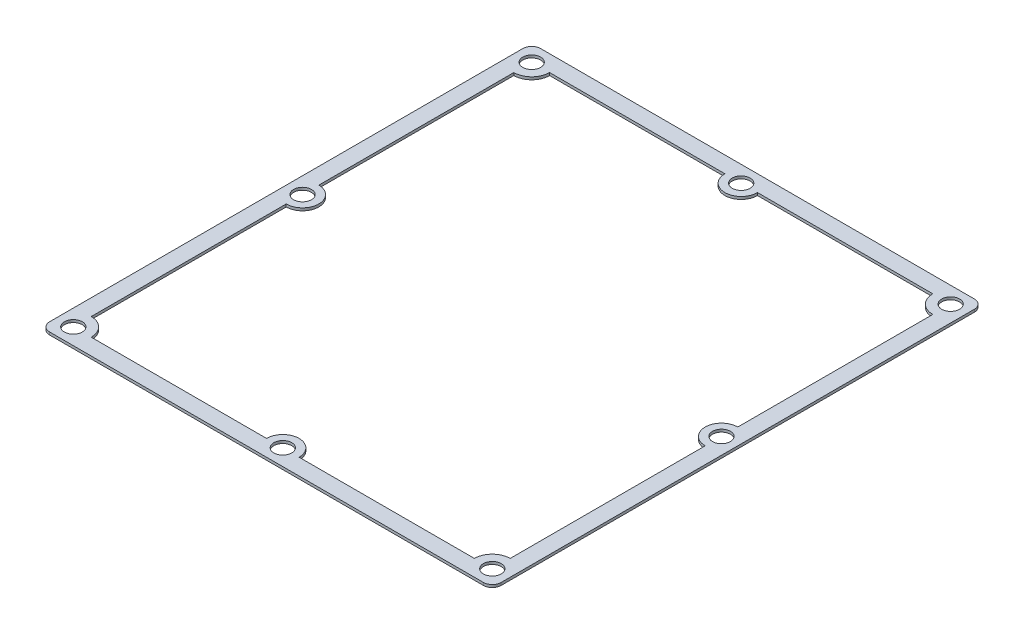
ISO-10303-21;
HEADER;
FILE_DESCRIPTION(('STEP AP214'),'2;1');
FILE_NAME('part.step','',(''),(''),'','','');
FILE_SCHEMA(('AUTOMOTIVE_DESIGN { 1 0 10303 214 1 1 1 1 }'));
ENDSEC;
DATA;
#1=APPLICATION_CONTEXT('core data for automotive mechanical design processes');
#2=APPLICATION_PROTOCOL_DEFINITION('international standard','automotive_design',2000,#1);
#3=PRODUCT_CONTEXT('',#1,'mechanical');
#4=PRODUCT('Part','Part','',(#3));
#5=PRODUCT_RELATED_PRODUCT_CATEGORY('part','',(#4));
#6=PRODUCT_DEFINITION_FORMATION('','',#4);
#7=PRODUCT_DEFINITION_CONTEXT('part definition',#1,'design');
#8=PRODUCT_DEFINITION('design','',#6,#7);
#9=PRODUCT_DEFINITION_SHAPE('','',#8);
#10=(LENGTH_UNIT() NAMED_UNIT(*) SI_UNIT(.MILLI.,.METRE.));
#11=(NAMED_UNIT(*) PLANE_ANGLE_UNIT() SI_UNIT($,.RADIAN.));
#12=(NAMED_UNIT(*) SI_UNIT($,.STERADIAN.) SOLID_ANGLE_UNIT());
#13=UNCERTAINTY_MEASURE_WITH_UNIT(LENGTH_MEASURE(1.E-05),#10,'distance_accuracy_value','');
#14=(GEOMETRIC_REPRESENTATION_CONTEXT(3) GLOBAL_UNCERTAINTY_ASSIGNED_CONTEXT((#13)) GLOBAL_UNIT_ASSIGNED_CONTEXT((#10,
#11,#12)) REPRESENTATION_CONTEXT('',''));
#15=CARTESIAN_POINT('',(0.,0.,0.));
#16=DIRECTION('',(0.,0.,1.));
#17=DIRECTION('',(1.,0.,0.));
#18=AXIS2_PLACEMENT_3D('',#15,#16,#17);
#19=CARTESIAN_POINT('',(-40.7710311675715,0.5,45.2112491208101));
#20=DIRECTION('',(0.,1.,0.));
#21=DIRECTION('',(0.,0.,1.));
#22=AXIS2_PLACEMENT_3D('',#19,#20,#21);
#23=PLANE('',#22);
#24=CARTESIAN_POINT('',(0.47896883242847,0.5,-43.3887508791899));
#25=DIRECTION('',(0.,1.,0.));
#26=DIRECTION('',(0.,0.,1.));
#27=AXIS2_PLACEMENT_3D('',#24,#25,#26);
#28=CIRCLE('',#27,1.7);
#29=CARTESIAN_POINT('',(0.47896883242847,0.5,-41.6887508791899));
#30=VERTEX_POINT('',#29);
#31=EDGE_CURVE('E323',#30,#30,#28,.T.);
#32=ORIENTED_EDGE('',*,*,#31,.F.);
#33=EDGE_LOOP('',(#32));
#34=FACE_BOUND('',#33,.T.);
#35=CARTESIAN_POINT('',(40.3289688324285,0.5,0.211249120810129));
#36=DIRECTION('',(0.,1.,0.));
#37=DIRECTION('',(0.,0.,1.));
#38=AXIS2_PLACEMENT_3D('',#35,#36,#37);
#39=CIRCLE('',#38,1.7);
#40=CARTESIAN_POINT('',(40.3289688324285,0.5,1.91124912081013));
#41=VERTEX_POINT('',#40);
#42=EDGE_CURVE('E335',#41,#41,#39,.T.);
#43=ORIENTED_EDGE('',*,*,#42,.F.);
#44=EDGE_LOOP('',(#43));
#45=FACE_BOUND('',#44,.T.);
#46=CARTESIAN_POINT('',(0.47896883242847,0.5,43.8112491208101));
#47=DIRECTION('',(0.,1.,0.));
#48=DIRECTION('',(0.,0.,1.));
#49=AXIS2_PLACEMENT_3D('',#46,#47,#48);
#50=CIRCLE('',#49,1.7);
#51=CARTESIAN_POINT('',(0.47896883242847,0.5,45.5112491208101));
#52=VERTEX_POINT('',#51);
#53=EDGE_CURVE('E347',#52,#52,#50,.T.);
#54=ORIENTED_EDGE('',*,*,#53,.F.);
#55=EDGE_LOOP('',(#54));
#56=FACE_BOUND('',#55,.T.);
#57=CARTESIAN_POINT('',(-39.3710311675715,0.5,0.211249120810129));
#58=DIRECTION('',(0.,1.,0.));
#59=DIRECTION('',(0.,0.,1.));
#60=AXIS2_PLACEMENT_3D('',#57,#58,#59);
#61=CIRCLE('',#60,1.7);
#62=CARTESIAN_POINT('',(-39.3710311675715,0.5,1.91124912081013));
#63=VERTEX_POINT('',#62);
#64=EDGE_CURVE('E359',#63,#63,#61,.T.);
#65=ORIENTED_EDGE('',*,*,#64,.F.);
#66=EDGE_LOOP('',(#65));
#67=FACE_BOUND('',#66,.T.);
#68=CARTESIAN_POINT('',(-40.7710311675715,0.5,45.2112491208101));
#69=DIRECTION('',(0.,1.,0.));
#70=DIRECTION('',(0.,0.,1.));
#71=AXIS2_PLACEMENT_3D('',#68,#69,#70);
#72=CIRCLE('',#71,1.7);
#73=CARTESIAN_POINT('',(-42.4710311675715,0.5,45.2112491208101));
#74=VERTEX_POINT('',#73);
#75=CARTESIAN_POINT('',(-40.7710311675715,0.5,46.9112491208101));
#76=VERTEX_POINT('',#75);
#77=EDGE_CURVE('E365',#74,#76,#72,.T.);
#78=ORIENTED_EDGE('',*,*,#77,.T.);
#79=DIRECTION('',(1.,0.,0.));
#80=VECTOR('',#79,1.);
#81=CARTESIAN_POINT('',(-40.7710311675715,0.5,46.9112491208101));
#82=LINE('',#81,#80);
#83=CARTESIAN_POINT('',(41.7289688324285,0.5,46.9112491208104));
#84=VERTEX_POINT('',#83);
#85=EDGE_CURVE('E368',#76,#84,#82,.T.);
#86=ORIENTED_EDGE('',*,*,#85,.T.);
#87=CARTESIAN_POINT('',(41.7289688324285,0.5,45.2112491208101));
#88=DIRECTION('',(0.,1.,0.));
#89=DIRECTION('',(0.,0.,1.));
#90=AXIS2_PLACEMENT_3D('',#87,#88,#89);
#91=CIRCLE('',#90,1.70000000000027);
#92=CARTESIAN_POINT('',(43.428968832429,0.5,45.21124912081));
#93=VERTEX_POINT('',#92);
#94=EDGE_CURVE('E371',#84,#93,#91,.T.);
#95=ORIENTED_EDGE('',*,*,#94,.T.);
#96=DIRECTION('',(0.,0.,-1.));
#97=VECTOR('',#96,1.);
#98=CARTESIAN_POINT('',(43.428968832429,0.5,45.21124912081));
#99=LINE('',#98,#97);
#100=CARTESIAN_POINT('',(43.4289688324295,0.5,-44.78875087919));
#101=VERTEX_POINT('',#100);
#102=EDGE_CURVE('E373',#93,#101,#99,.T.);
#103=ORIENTED_EDGE('',*,*,#102,.T.);
#104=CARTESIAN_POINT('',(41.7289688324295,0.5,-44.7887508791899));
#105=DIRECTION('',(0.,1.,0.));
#106=DIRECTION('',(0.,0.,1.));
#107=AXIS2_PLACEMENT_3D('',#104,#105,#106);
#108=CIRCLE('',#107,1.70000000000001);
#109=CARTESIAN_POINT('',(41.7289688324274,0.5,-46.4887508791899));
#110=VERTEX_POINT('',#109);
#111=EDGE_CURVE('E375',#101,#110,#108,.T.);
#112=ORIENTED_EDGE('',*,*,#111,.T.);
#113=DIRECTION('',(-1.,0.,0.));
#114=VECTOR('',#113,1.);
#115=CARTESIAN_POINT('',(41.7289688324274,0.5,-46.4887508791899));
#116=LINE('',#115,#114);
#117=CARTESIAN_POINT('',(-40.7710311675705,0.5,-46.4887508791899));
#118=VERTEX_POINT('',#117);
#119=EDGE_CURVE('E377',#110,#118,#116,.T.);
#120=ORIENTED_EDGE('',*,*,#119,.T.);
#121=CARTESIAN_POINT('',(-40.7710311675715,0.5,-44.7887508791899));
#122=DIRECTION('',(0.,1.,0.));
#123=DIRECTION('',(0.,0.,1.));
#124=AXIS2_PLACEMENT_3D('',#121,#122,#123);
#125=CIRCLE('',#124,1.7);
#126=CARTESIAN_POINT('',(-42.4710311675715,0.5,-44.7887508791899));
#127=VERTEX_POINT('',#126);
#128=EDGE_CURVE('E379',#118,#127,#125,.T.);
#129=ORIENTED_EDGE('',*,*,#128,.T.);
#130=DIRECTION('',(0.,0.,1.));
#131=VECTOR('',#130,1.);
#132=CARTESIAN_POINT('',(-42.4710311675715,0.5,-44.7887508791899));
#133=LINE('',#132,#131);
#134=EDGE_CURVE('E381',#127,#74,#133,.T.);
#135=ORIENTED_EDGE('',*,*,#134,.T.);
#136=EDGE_LOOP('',(#78,#86,#95,#103,#112,#120,#129,#135));
#137=FACE_BOUND('',#136,.T.);
#138=CARTESIAN_POINT('',(-39.3710311675715,0.5,43.8112491208101));
#139=DIRECTION('',(0.,1.,0.));
#140=DIRECTION('',(0.,0.,1.));
#141=AXIS2_PLACEMENT_3D('',#138,#139,#140);
#142=CIRCLE('',#141,1.7);
#143=CARTESIAN_POINT('',(-39.3710311675715,0.5,45.5112491208101));
#144=VERTEX_POINT('',#143);
#145=EDGE_CURVE('E353',#144,#144,#142,.T.);
#146=ORIENTED_EDGE('',*,*,#145,.F.);
#147=EDGE_LOOP('',(#146));
#148=FACE_BOUND('',#147,.T.);
#149=CARTESIAN_POINT('',(40.3289688324285,0.5,43.8112491208101));
#150=DIRECTION('',(0.,1.,0.));
#151=DIRECTION('',(0.,0.,1.));
#152=AXIS2_PLACEMENT_3D('',#149,#150,#151);
#153=CIRCLE('',#152,1.7);
#154=CARTESIAN_POINT('',(40.3289688324285,0.5,45.5112491208101));
#155=VERTEX_POINT('',#154);
#156=EDGE_CURVE('E341',#155,#155,#153,.T.);
#157=ORIENTED_EDGE('',*,*,#156,.F.);
#158=EDGE_LOOP('',(#157));
#159=FACE_BOUND('',#158,.T.);
#160=CARTESIAN_POINT('',(40.3289688324285,0.5,-43.3887508791899));
#161=DIRECTION('',(0.,1.,0.));
#162=DIRECTION('',(0.,0.,1.));
#163=AXIS2_PLACEMENT_3D('',#160,#161,#162);
#164=CIRCLE('',#163,1.7);
#165=CARTESIAN_POINT('',(40.3289688324285,0.5,-41.6887508791899));
#166=VERTEX_POINT('',#165);
#167=EDGE_CURVE('E329',#166,#166,#164,.T.);
#168=ORIENTED_EDGE('',*,*,#167,.F.);
#169=EDGE_LOOP('',(#168));
#170=FACE_BOUND('',#169,.T.);
#171=CARTESIAN_POINT('',(-39.3710311675715,0.5,-43.3887508791899));
#172=DIRECTION('',(0.,1.,0.));
#173=DIRECTION('',(0.,0.,1.));
#174=AXIS2_PLACEMENT_3D('',#171,#172,#173);
#175=CIRCLE('',#174,1.7);
#176=CARTESIAN_POINT('',(-39.3710311675715,0.5,-41.6887508791899));
#177=VERTEX_POINT('',#176);
#178=EDGE_CURVE('E317',#177,#177,#175,.T.);
#179=ORIENTED_EDGE('',*,*,#178,.F.);
#180=EDGE_LOOP('',(#179));
#181=FACE_BOUND('',#180,.T.);
#182=DIRECTION('',(-1.,0.,0.));
#183=VECTOR('',#182,1.);
#184=CARTESIAN_POINT('',(-35.969560897233,0.5,-43.3887508791899));
#185=LINE('',#184,#183);
#186=CARTESIAN_POINT('',(-2.62103116757153,0.5,-43.3887508791899));
#187=VERTEX_POINT('',#186);
#188=CARTESIAN_POINT('',(-35.969560897233,0.5,-43.3887508791899));
#189=VERTEX_POINT('',#188);
#190=EDGE_CURVE('E204',#187,#189,#185,.T.);
#191=ORIENTED_EDGE('',*,*,#190,.F.);
#192=CARTESIAN_POINT('',(0.47896883242847,0.5,-43.3887508791899));
#193=DIRECTION('',(0.,-1.,0.));
#194=DIRECTION('',(0.,0.,1.));
#195=AXIS2_PLACEMENT_3D('',#192,#193,#194);
#196=CIRCLE('',#195,3.1);
#197=CARTESIAN_POINT('',(3.57896883242847,0.5,-43.3887508791899));
#198=VERTEX_POINT('',#197);
#199=EDGE_CURVE('E196',#198,#187,#196,.T.);
#200=ORIENTED_EDGE('',*,*,#199,.F.);
#201=DIRECTION('',(-1.,0.,0.));
#202=VECTOR('',#201,1.);
#203=CARTESIAN_POINT('',(3.57896883242847,0.5,-43.3887508791899));
#204=LINE('',#203,#202);
#205=CARTESIAN_POINT('',(36.9274985620899,0.5,-43.3887508791899));
#206=VERTEX_POINT('',#205);
#207=EDGE_CURVE('E245',#206,#198,#204,.T.);
#208=ORIENTED_EDGE('',*,*,#207,.F.);
#209=CARTESIAN_POINT('',(40.3289688324285,0.5,-43.3887508791899));
#210=DIRECTION('',(0.,-1.,0.));
#211=DIRECTION('',(0.,0.,-1.));
#212=AXIS2_PLACEMENT_3D('',#209,#210,#211);
#213=CIRCLE('',#212,3.40147027033854);
#214=CARTESIAN_POINT('',(40.3289688324285,0.5,-39.9872806088513));
#215=VERTEX_POINT('',#214);
#216=EDGE_CURVE('E243',#215,#206,#213,.T.);
#217=ORIENTED_EDGE('',*,*,#216,.F.);
#218=DIRECTION('',(0.,0.,-1.));
#219=VECTOR('',#218,1.);
#220=CARTESIAN_POINT('',(40.3289688324285,0.5,-39.9872806088513));
#221=LINE('',#220,#219);
#222=CARTESIAN_POINT('',(40.3289688324285,0.5,-2.88875087919069));
#223=VERTEX_POINT('',#222);
#224=EDGE_CURVE('E241',#223,#215,#221,.T.);
#225=ORIENTED_EDGE('',*,*,#224,.F.);
#226=CARTESIAN_POINT('',(40.3289688324285,0.5,0.211249120810129));
#227=DIRECTION('',(0.,-1.,0.));
#228=DIRECTION('',(0.,0.,1.));
#229=AXIS2_PLACEMENT_3D('',#226,#227,#228);
#230=CIRCLE('',#229,3.10000000000082);
#231=CARTESIAN_POINT('',(40.3289688324285,0.5,3.31124912081095));
#232=VERTEX_POINT('',#231);
#233=EDGE_CURVE('E239',#232,#223,#230,.T.);
#234=ORIENTED_EDGE('',*,*,#233,.F.);
#235=DIRECTION('',(0.,0.,-1.));
#236=VECTOR('',#235,1.);
#237=CARTESIAN_POINT('',(40.3289688324285,0.5,3.31124912081095));
#238=LINE('',#237,#236);
#239=CARTESIAN_POINT('',(40.3289688324285,0.5,40.4097788504714));
#240=VERTEX_POINT('',#239);
#241=EDGE_CURVE('E237',#240,#232,#238,.T.);
#242=ORIENTED_EDGE('',*,*,#241,.F.);
#243=CARTESIAN_POINT('',(40.3289688324285,0.5,43.8112491208101));
#244=DIRECTION('',(0.,-1.,0.));
#245=DIRECTION('',(0.,0.,1.));
#246=AXIS2_PLACEMENT_3D('',#243,#244,#245);
#247=CIRCLE('',#246,3.40147027033863);
#248=CARTESIAN_POINT('',(36.9274985620898,0.5,43.8112491208099));
#249=VERTEX_POINT('',#248);
#250=EDGE_CURVE('E235',#249,#240,#247,.T.);
#251=ORIENTED_EDGE('',*,*,#250,.F.);
#252=DIRECTION('',(1.,0.,0.));
#253=VECTOR('',#252,1.);
#254=CARTESIAN_POINT('',(3.57896883242855,0.5,43.81124912081));
#255=LINE('',#254,#253);
#256=CARTESIAN_POINT('',(3.57896883242855,0.5,43.81124912081));
#257=VERTEX_POINT('',#256);
#258=EDGE_CURVE('E233',#257,#249,#255,.T.);
#259=ORIENTED_EDGE('',*,*,#258,.F.);
#260=CARTESIAN_POINT('',(0.47896883242847,0.5,43.8112491208101));
#261=DIRECTION('',(0.,-1.,0.));
#262=DIRECTION('',(0.,0.,-1.));
#263=AXIS2_PLACEMENT_3D('',#260,#261,#262);
#264=CIRCLE('',#263,3.1);
#265=CARTESIAN_POINT('',(-2.62103116757153,0.5,43.81124912081));
#266=VERTEX_POINT('',#265);
#267=EDGE_CURVE('E231',#266,#257,#264,.T.);
#268=ORIENTED_EDGE('',*,*,#267,.F.);
#269=DIRECTION('',(1.,0.,0.));
#270=VECTOR('',#269,1.);
#271=CARTESIAN_POINT('',(-35.9695608972328,0.5,43.8112491208101));
#272=LINE('',#271,#270);
#273=CARTESIAN_POINT('',(-35.9695608972328,0.5,43.8112491208101));
#274=VERTEX_POINT('',#273);
#275=EDGE_CURVE('E229',#274,#266,#272,.T.);
#276=ORIENTED_EDGE('',*,*,#275,.F.);
#277=CARTESIAN_POINT('',(-39.3710311675715,0.5,43.8112491208101));
#278=DIRECTION('',(0.,-1.,0.));
#279=DIRECTION('',(0.,0.,-1.));
#280=AXIS2_PLACEMENT_3D('',#277,#278,#279);
#281=CIRCLE('',#280,3.40147027033863);
#282=CARTESIAN_POINT('',(-39.3710311675714,0.5,40.4097788504715));
#283=VERTEX_POINT('',#282);
#284=EDGE_CURVE('E227',#283,#274,#281,.T.);
#285=ORIENTED_EDGE('',*,*,#284,.F.);
#286=DIRECTION('',(0.,0.,1.));
#287=VECTOR('',#286,1.);
#288=CARTESIAN_POINT('',(-39.3710311675715,0.5,3.31124912081014));
#289=LINE('',#288,#287);
#290=CARTESIAN_POINT('',(-39.3710311675715,0.5,3.31124912081014));
#291=VERTEX_POINT('',#290);
#292=EDGE_CURVE('E225',#291,#283,#289,.T.);
#293=ORIENTED_EDGE('',*,*,#292,.F.);
#294=CARTESIAN_POINT('',(-39.3710311675715,0.5,0.211249120810129));
#295=DIRECTION('',(0.,-1.,0.));
#296=DIRECTION('',(0.,0.,1.));
#297=AXIS2_PLACEMENT_3D('',#294,#295,#296);
#298=CIRCLE('',#297,3.10000000000001);
#299=CARTESIAN_POINT('',(-39.3710311675715,0.5,-2.88875087918988));
#300=VERTEX_POINT('',#299);
#301=EDGE_CURVE('E223',#300,#291,#298,.T.);
#302=ORIENTED_EDGE('',*,*,#301,.F.);
#303=DIRECTION('',(0.,0.,1.));
#304=VECTOR('',#303,1.);
#305=CARTESIAN_POINT('',(-39.3710311675715,0.5,-39.9872806088513));
#306=LINE('',#305,#304);
#307=CARTESIAN_POINT('',(-39.3710311675715,0.5,-39.9872806088513));
#308=VERTEX_POINT('',#307);
#309=EDGE_CURVE('E219',#308,#300,#306,.T.);
#310=ORIENTED_EDGE('',*,*,#309,.F.);
#311=CARTESIAN_POINT('',(-39.3710311675715,0.5,-43.3887508791899));
#312=DIRECTION('',(0.,-1.,0.));
#313=DIRECTION('',(0.,0.,1.));
#314=AXIS2_PLACEMENT_3D('',#311,#312,#313);
#315=CIRCLE('',#314,3.40147027033856);
#316=EDGE_CURVE('E217',#189,#308,#315,.T.);
#317=ORIENTED_EDGE('',*,*,#316,.F.);
#318=EDGE_LOOP('',(#191,#200,#208,#217,#225,#234,#242,#251,#259,#268,#276,#285,#293,#302,#310,#317));
#319=FACE_BOUND('',#318,.T.);
#320=ADVANCED_FACE('F35',(#34,#45,#56,#67,#137,#148,#159,#170,#181,#319),#23,.T.);
#321=CARTESIAN_POINT('',(-40.7710311675715,0.,45.2112491208101));
#322=DIRECTION('',(0.,1.,0.));
#323=DIRECTION('',(0.,0.,1.));
#324=AXIS2_PLACEMENT_3D('',#321,#322,#323);
#325=PLANE('',#324);
#326=CARTESIAN_POINT('',(-39.3710311675715,0.,-43.3887508791899));
#327=DIRECTION('',(0.,1.,0.));
#328=DIRECTION('',(0.,0.,1.));
#329=AXIS2_PLACEMENT_3D('',#326,#327,#328);
#330=CIRCLE('',#329,1.7);
#331=CARTESIAN_POINT('',(-39.3710311675715,0.,-41.6887508791899));
#332=VERTEX_POINT('',#331);
#333=EDGE_CURVE('E212',#332,#332,#330,.T.);
#334=ORIENTED_EDGE('',*,*,#333,.T.);
#335=EDGE_LOOP('',(#334));
#336=FACE_BOUND('',#335,.T.);
#337=CARTESIAN_POINT('',(0.47896883242847,0.,-43.3887508791899));
#338=DIRECTION('',(0.,1.,0.));
#339=DIRECTION('',(0.,0.,1.));
#340=AXIS2_PLACEMENT_3D('',#337,#338,#339);
#341=CIRCLE('',#340,1.7);
#342=CARTESIAN_POINT('',(0.47896883242847,0.,-41.6887508791899));
#343=VERTEX_POINT('',#342);
#344=EDGE_CURVE('E320',#343,#343,#341,.T.);
#345=ORIENTED_EDGE('',*,*,#344,.T.);
#346=EDGE_LOOP('',(#345));
#347=FACE_BOUND('',#346,.T.);
#348=CARTESIAN_POINT('',(40.3289688324285,0.,-43.3887508791899));
#349=DIRECTION('',(0.,1.,0.));
#350=DIRECTION('',(0.,0.,1.));
#351=AXIS2_PLACEMENT_3D('',#348,#349,#350);
#352=CIRCLE('',#351,1.7);
#353=CARTESIAN_POINT('',(40.3289688324285,0.,-41.6887508791899));
#354=VERTEX_POINT('',#353);
#355=EDGE_CURVE('E326',#354,#354,#352,.T.);
#356=ORIENTED_EDGE('',*,*,#355,.T.);
#357=EDGE_LOOP('',(#356));
#358=FACE_BOUND('',#357,.T.);
#359=CARTESIAN_POINT('',(40.3289688324285,0.,0.211249120810129));
#360=DIRECTION('',(0.,1.,0.));
#361=DIRECTION('',(0.,0.,1.));
#362=AXIS2_PLACEMENT_3D('',#359,#360,#361);
#363=CIRCLE('',#362,1.7);
#364=CARTESIAN_POINT('',(40.3289688324285,0.,1.91124912081013));
#365=VERTEX_POINT('',#364);
#366=EDGE_CURVE('E332',#365,#365,#363,.T.);
#367=ORIENTED_EDGE('',*,*,#366,.T.);
#368=EDGE_LOOP('',(#367));
#369=FACE_BOUND('',#368,.T.);
#370=CARTESIAN_POINT('',(40.3289688324285,0.,43.8112491208101));
#371=DIRECTION('',(0.,1.,0.));
#372=DIRECTION('',(0.,0.,1.));
#373=AXIS2_PLACEMENT_3D('',#370,#371,#372);
#374=CIRCLE('',#373,1.7);
#375=CARTESIAN_POINT('',(40.3289688324285,0.,45.5112491208101));
#376=VERTEX_POINT('',#375);
#377=EDGE_CURVE('E338',#376,#376,#374,.T.);
#378=ORIENTED_EDGE('',*,*,#377,.T.);
#379=EDGE_LOOP('',(#378));
#380=FACE_BOUND('',#379,.T.);
#381=CARTESIAN_POINT('',(0.47896883242847,0.,43.8112491208101));
#382=DIRECTION('',(0.,1.,0.));
#383=DIRECTION('',(0.,0.,1.));
#384=AXIS2_PLACEMENT_3D('',#381,#382,#383);
#385=CIRCLE('',#384,1.7);
#386=CARTESIAN_POINT('',(0.47896883242847,0.,45.5112491208101));
#387=VERTEX_POINT('',#386);
#388=EDGE_CURVE('E344',#387,#387,#385,.T.);
#389=ORIENTED_EDGE('',*,*,#388,.T.);
#390=EDGE_LOOP('',(#389));
#391=FACE_BOUND('',#390,.T.);
#392=CARTESIAN_POINT('',(-39.3710311675715,0.,43.8112491208101));
#393=DIRECTION('',(0.,1.,0.));
#394=DIRECTION('',(0.,0.,1.));
#395=AXIS2_PLACEMENT_3D('',#392,#393,#394);
#396=CIRCLE('',#395,1.7);
#397=CARTESIAN_POINT('',(-39.3710311675715,0.,45.5112491208101));
#398=VERTEX_POINT('',#397);
#399=EDGE_CURVE('E350',#398,#398,#396,.T.);
#400=ORIENTED_EDGE('',*,*,#399,.T.);
#401=EDGE_LOOP('',(#400));
#402=FACE_BOUND('',#401,.T.);
#403=CARTESIAN_POINT('',(-39.3710311675715,0.,0.211249120810129));
#404=DIRECTION('',(0.,1.,0.));
#405=DIRECTION('',(0.,0.,1.));
#406=AXIS2_PLACEMENT_3D('',#403,#404,#405);
#407=CIRCLE('',#406,1.7);
#408=CARTESIAN_POINT('',(-39.3710311675715,0.,1.91124912081013));
#409=VERTEX_POINT('',#408);
#410=EDGE_CURVE('E356',#409,#409,#407,.T.);
#411=ORIENTED_EDGE('',*,*,#410,.T.);
#412=EDGE_LOOP('',(#411));
#413=FACE_BOUND('',#412,.T.);
#414=CARTESIAN_POINT('',(-40.7710311675715,0.,45.2112491208101));
#415=DIRECTION('',(0.,1.,0.));
#416=DIRECTION('',(0.,0.,1.));
#417=AXIS2_PLACEMENT_3D('',#414,#415,#416);
#418=CIRCLE('',#417,1.7);
#419=CARTESIAN_POINT('',(-42.4710311675715,0.,45.2112491208101));
#420=VERTEX_POINT('',#419);
#421=CARTESIAN_POINT('',(-40.7710311675715,0.,46.9112491208101));
#422=VERTEX_POINT('',#421);
#423=EDGE_CURVE('E362',#420,#422,#418,.T.);
#424=ORIENTED_EDGE('',*,*,#423,.F.);
#425=DIRECTION('',(0.,0.,1.));
#426=VECTOR('',#425,1.);
#427=CARTESIAN_POINT('',(-42.4710311675715,0.,-44.7887508791899));
#428=LINE('',#427,#426);
#429=CARTESIAN_POINT('',(-42.4710311675715,0.,-44.7887508791899));
#430=VERTEX_POINT('',#429);
#431=EDGE_CURVE('E369',#430,#420,#428,.T.);
#432=ORIENTED_EDGE('',*,*,#431,.F.);
#433=CARTESIAN_POINT('',(-40.7710311675715,0.,-44.7887508791899));
#434=DIRECTION('',(0.,1.,0.));
#435=DIRECTION('',(0.,0.,1.));
#436=AXIS2_PLACEMENT_3D('',#433,#434,#435);
#437=CIRCLE('',#436,1.7);
#438=CARTESIAN_POINT('',(-40.7710311675705,0.,-46.4887508791899));
#439=VERTEX_POINT('',#438);
#440=EDGE_CURVE('E396',#439,#430,#437,.T.);
#441=ORIENTED_EDGE('',*,*,#440,.F.);
#442=DIRECTION('',(-1.,0.,0.));
#443=VECTOR('',#442,1.);
#444=CARTESIAN_POINT('',(41.7289688324274,0.,-46.4887508791899));
#445=LINE('',#444,#443);
#446=CARTESIAN_POINT('',(41.7289688324274,0.,-46.4887508791899));
#447=VERTEX_POINT('',#446);
#448=EDGE_CURVE('E394',#447,#439,#445,.T.);
#449=ORIENTED_EDGE('',*,*,#448,.F.);
#450=CARTESIAN_POINT('',(41.7289688324295,0.,-44.7887508791899));
#451=DIRECTION('',(0.,1.,0.));
#452=DIRECTION('',(0.,0.,1.));
#453=AXIS2_PLACEMENT_3D('',#450,#451,#452);
#454=CIRCLE('',#453,1.70000000000001);
#455=CARTESIAN_POINT('',(43.4289688324295,0.,-44.78875087919));
#456=VERTEX_POINT('',#455);
#457=EDGE_CURVE('E392',#456,#447,#454,.T.);
#458=ORIENTED_EDGE('',*,*,#457,.F.);
#459=DIRECTION('',(0.,0.,-1.));
#460=VECTOR('',#459,1.);
#461=CARTESIAN_POINT('',(43.428968832429,0.,45.21124912081));
#462=LINE('',#461,#460);
#463=CARTESIAN_POINT('',(43.428968832429,0.,45.21124912081));
#464=VERTEX_POINT('',#463);
#465=EDGE_CURVE('E390',#464,#456,#462,.T.);
#466=ORIENTED_EDGE('',*,*,#465,.F.);
#467=CARTESIAN_POINT('',(41.7289688324285,0.,45.2112491208101));
#468=DIRECTION('',(0.,1.,0.));
#469=DIRECTION('',(0.,0.,1.));
#470=AXIS2_PLACEMENT_3D('',#467,#468,#469);
#471=CIRCLE('',#470,1.70000000000027);
#472=CARTESIAN_POINT('',(41.7289688324285,0.,46.9112491208104));
#473=VERTEX_POINT('',#472);
#474=EDGE_CURVE('E388',#473,#464,#471,.T.);
#475=ORIENTED_EDGE('',*,*,#474,.F.);
#476=DIRECTION('',(1.,0.,0.));
#477=VECTOR('',#476,1.);
#478=CARTESIAN_POINT('',(-40.7710311675715,0.,46.9112491208101));
#479=LINE('',#478,#477);
#480=EDGE_CURVE('E386',#422,#473,#479,.T.);
#481=ORIENTED_EDGE('',*,*,#480,.F.);
#482=EDGE_LOOP('',(#424,#432,#441,#449,#458,#466,#475,#481));
#483=FACE_BOUND('',#482,.T.);
#484=CARTESIAN_POINT('',(0.47896883242847,0.,-43.3887508791899));
#485=DIRECTION('',(0.,-1.,0.));
#486=DIRECTION('',(0.,0.,1.));
#487=AXIS2_PLACEMENT_3D('',#484,#485,#486);
#488=CIRCLE('',#487,3.1);
#489=CARTESIAN_POINT('',(3.57896883242847,0.,-43.3887508791899));
#490=VERTEX_POINT('',#489);
#491=CARTESIAN_POINT('',(-2.62103116757153,0.,-43.3887508791899));
#492=VERTEX_POINT('',#491);
#493=EDGE_CURVE('E58',#490,#492,#488,.T.);
#494=ORIENTED_EDGE('',*,*,#493,.T.);
#495=DIRECTION('',(-1.,0.,0.));
#496=VECTOR('',#495,1.);
#497=CARTESIAN_POINT('',(-35.969560897233,0.,-43.3887508791899));
#498=LINE('',#497,#496);
#499=CARTESIAN_POINT('',(-35.969560897233,0.,-43.3887508791899));
#500=VERTEX_POINT('',#499);
#501=EDGE_CURVE('E211',#492,#500,#498,.T.);
#502=ORIENTED_EDGE('',*,*,#501,.T.);
#503=CARTESIAN_POINT('',(-39.3710311675715,0.,-43.3887508791899));
#504=DIRECTION('',(0.,-1.,0.));
#505=DIRECTION('',(0.,0.,1.));
#506=AXIS2_PLACEMENT_3D('',#503,#504,#505);
#507=CIRCLE('',#506,3.40147027033856);
#508=CARTESIAN_POINT('',(-39.3710311675715,0.,-39.9872806088513));
#509=VERTEX_POINT('',#508);
#510=EDGE_CURVE('E249',#500,#509,#507,.T.);
#511=ORIENTED_EDGE('',*,*,#510,.T.);
#512=DIRECTION('',(0.,0.,1.));
#513=VECTOR('',#512,1.);
#514=CARTESIAN_POINT('',(-39.3710311675715,0.,-39.9872806088513));
#515=LINE('',#514,#513);
#516=CARTESIAN_POINT('',(-39.3710311675715,0.,-2.88875087918988));
#517=VERTEX_POINT('',#516);
#518=EDGE_CURVE('E252',#509,#517,#515,.T.);
#519=ORIENTED_EDGE('',*,*,#518,.T.);
#520=CARTESIAN_POINT('',(-39.3710311675715,0.,0.211249120810129));
#521=DIRECTION('',(0.,-1.,0.));
#522=DIRECTION('',(0.,0.,1.));
#523=AXIS2_PLACEMENT_3D('',#520,#521,#522);
#524=CIRCLE('',#523,3.10000000000001);
#525=CARTESIAN_POINT('',(-39.3710311675715,0.,3.31124912081014));
#526=VERTEX_POINT('',#525);
#527=EDGE_CURVE('E255',#517,#526,#524,.T.);
#528=ORIENTED_EDGE('',*,*,#527,.T.);
#529=DIRECTION('',(0.,0.,1.));
#530=VECTOR('',#529,1.);
#531=CARTESIAN_POINT('',(-39.3710311675715,0.,3.31124912081014));
#532=LINE('',#531,#530);
#533=CARTESIAN_POINT('',(-39.3710311675714,0.,40.4097788504715));
#534=VERTEX_POINT('',#533);
#535=EDGE_CURVE('E258',#526,#534,#532,.T.);
#536=ORIENTED_EDGE('',*,*,#535,.T.);
#537=CARTESIAN_POINT('',(-39.3710311675715,0.,43.8112491208101));
#538=DIRECTION('',(0.,-1.,0.));
#539=DIRECTION('',(0.,0.,-1.));
#540=AXIS2_PLACEMENT_3D('',#537,#538,#539);
#541=CIRCLE('',#540,3.40147027033863);
#542=CARTESIAN_POINT('',(-35.9695608972328,0.,43.8112491208101));
#543=VERTEX_POINT('',#542);
#544=EDGE_CURVE('E261',#534,#543,#541,.T.);
#545=ORIENTED_EDGE('',*,*,#544,.T.);
#546=DIRECTION('',(1.,0.,0.));
#547=VECTOR('',#546,1.);
#548=CARTESIAN_POINT('',(-35.9695608972328,0.,43.8112491208101));
#549=LINE('',#548,#547);
#550=CARTESIAN_POINT('',(-2.62103116757153,0.,43.81124912081));
#551=VERTEX_POINT('',#550);
#552=EDGE_CURVE('E264',#543,#551,#549,.T.);
#553=ORIENTED_EDGE('',*,*,#552,.T.);
#554=CARTESIAN_POINT('',(0.47896883242847,0.,43.8112491208101));
#555=DIRECTION('',(0.,-1.,0.));
#556=DIRECTION('',(0.,0.,-1.));
#557=AXIS2_PLACEMENT_3D('',#554,#555,#556);
#558=CIRCLE('',#557,3.1);
#559=CARTESIAN_POINT('',(3.57896883242855,0.,43.81124912081));
#560=VERTEX_POINT('',#559);
#561=EDGE_CURVE('E267',#551,#560,#558,.T.);
#562=ORIENTED_EDGE('',*,*,#561,.T.);
#563=DIRECTION('',(1.,0.,0.));
#564=VECTOR('',#563,1.);
#565=CARTESIAN_POINT('',(3.57896883242855,0.,43.81124912081));
#566=LINE('',#565,#564);
#567=CARTESIAN_POINT('',(36.9274985620898,0.,43.8112491208099));
#568=VERTEX_POINT('',#567);
#569=EDGE_CURVE('E270',#560,#568,#566,.T.);
#570=ORIENTED_EDGE('',*,*,#569,.T.);
#571=CARTESIAN_POINT('',(40.3289688324285,0.,43.8112491208101));
#572=DIRECTION('',(0.,-1.,0.));
#573=DIRECTION('',(0.,0.,1.));
#574=AXIS2_PLACEMENT_3D('',#571,#572,#573);
#575=CIRCLE('',#574,3.40147027033863);
#576=CARTESIAN_POINT('',(40.3289688324285,0.,40.4097788504714));
#577=VERTEX_POINT('',#576);
#578=EDGE_CURVE('E273',#568,#577,#575,.T.);
#579=ORIENTED_EDGE('',*,*,#578,.T.);
#580=DIRECTION('',(0.,0.,-1.));
#581=VECTOR('',#580,1.);
#582=CARTESIAN_POINT('',(40.3289688324285,0.,3.31124912081095));
#583=LINE('',#582,#581);
#584=CARTESIAN_POINT('',(40.3289688324285,0.,3.31124912081095));
#585=VERTEX_POINT('',#584);
#586=EDGE_CURVE('E276',#577,#585,#583,.T.);
#587=ORIENTED_EDGE('',*,*,#586,.T.);
#588=CARTESIAN_POINT('',(40.3289688324285,0.,0.211249120810129));
#589=DIRECTION('',(0.,-1.,0.));
#590=DIRECTION('',(0.,0.,1.));
#591=AXIS2_PLACEMENT_3D('',#588,#589,#590);
#592=CIRCLE('',#591,3.10000000000082);
#593=CARTESIAN_POINT('',(40.3289688324285,0.,-2.88875087919069));
#594=VERTEX_POINT('',#593);
#595=EDGE_CURVE('E279',#585,#594,#592,.T.);
#596=ORIENTED_EDGE('',*,*,#595,.T.);
#597=DIRECTION('',(0.,0.,-1.));
#598=VECTOR('',#597,1.);
#599=CARTESIAN_POINT('',(40.3289688324285,0.,-39.9872806088513));
#600=LINE('',#599,#598);
#601=CARTESIAN_POINT('',(40.3289688324285,0.,-39.9872806088513));
#602=VERTEX_POINT('',#601);
#603=EDGE_CURVE('E282',#594,#602,#600,.T.);
#604=ORIENTED_EDGE('',*,*,#603,.T.);
#605=CARTESIAN_POINT('',(40.3289688324285,0.,-43.3887508791899));
#606=DIRECTION('',(0.,-1.,0.));
#607=DIRECTION('',(0.,0.,-1.));
#608=AXIS2_PLACEMENT_3D('',#605,#606,#607);
#609=CIRCLE('',#608,3.40147027033854);
#610=CARTESIAN_POINT('',(36.9274985620899,0.,-43.3887508791899));
#611=VERTEX_POINT('',#610);
#612=EDGE_CURVE('E285',#602,#611,#609,.T.);
#613=ORIENTED_EDGE('',*,*,#612,.T.);
#614=DIRECTION('',(-1.,0.,0.));
#615=VECTOR('',#614,1.);
#616=CARTESIAN_POINT('',(3.57896883242847,0.,-43.3887508791899));
#617=LINE('',#616,#615);
#618=EDGE_CURVE('E205',#611,#490,#617,.T.);
#619=ORIENTED_EDGE('',*,*,#618,.T.);
#620=EDGE_LOOP('',(#494,#502,#511,#519,#528,#536,#545,#553,#562,#570,#579,#587,#596,#604,#613,#619));
#621=FACE_BOUND('',#620,.T.);
#622=ADVANCED_FACE('F426',(#336,#347,#358,#369,#380,#391,#402,#413,#483,#621),#325,.F.);
#623=CARTESIAN_POINT('',(-40.7710311675715,0.5,45.2112491208101));
#624=DIRECTION('',(0.,-1.,0.));
#625=DIRECTION('',(0.,0.,-1.));
#626=AXIS2_PLACEMENT_3D('',#623,#624,#625);
#627=CYLINDRICAL_SURFACE('',#626,1.7);
#628=ORIENTED_EDGE('',*,*,#423,.T.);
#629=DIRECTION('',(0.,-1.,0.));
#630=VECTOR('',#629,1.);
#631=CARTESIAN_POINT('',(-40.7710311675715,0.5,46.9112491208101));
#632=LINE('',#631,#630);
#633=EDGE_CURVE('E11',#76,#422,#632,.T.);
#634=ORIENTED_EDGE('',*,*,#633,.F.);
#635=ORIENTED_EDGE('',*,*,#77,.F.);
#636=DIRECTION('',(0.,-1.,0.));
#637=VECTOR('',#636,1.);
#638=CARTESIAN_POINT('',(-42.4710311675715,0.5,45.2112491208101));
#639=LINE('',#638,#637);
#640=EDGE_CURVE('E383',#74,#420,#639,.T.);
#641=ORIENTED_EDGE('',*,*,#640,.T.);
#642=EDGE_LOOP('',(#628,#634,#635,#641));
#643=FACE_BOUND('',#642,.T.);
#644=ADVANCED_FACE('F37',(#643),#627,.T.);
#645=CARTESIAN_POINT('',(-40.7710311675715,0.5,46.9112491208101));
#646=DIRECTION('',(0.,0.,-1.));
#647=DIRECTION('',(-1.,0.,0.));
#648=AXIS2_PLACEMENT_3D('',#645,#646,#647);
#649=PLANE('',#648);
#650=ORIENTED_EDGE('',*,*,#480,.T.);
#651=DIRECTION('',(0.,-1.,0.));
#652=VECTOR('',#651,1.);
#653=CARTESIAN_POINT('',(41.7289688324285,0.5,46.9112491208104));
#654=LINE('',#653,#652);
#655=EDGE_CURVE('E43',#84,#473,#654,.T.);
#656=ORIENTED_EDGE('',*,*,#655,.F.);
#657=ORIENTED_EDGE('',*,*,#85,.F.);
#658=ORIENTED_EDGE('',*,*,#633,.T.);
#659=EDGE_LOOP('',(#650,#656,#657,#658));
#660=FACE_BOUND('',#659,.T.);
#661=ADVANCED_FACE('F444',(#660),#649,.F.);
#662=CARTESIAN_POINT('',(41.7289688324285,0.5,45.2112491208101));
#663=DIRECTION('',(0.,-1.,0.));
#664=DIRECTION('',(0.,0.,-1.));
#665=AXIS2_PLACEMENT_3D('',#662,#663,#664);
#666=CYLINDRICAL_SURFACE('',#665,1.70000000000027);
#667=ORIENTED_EDGE('',*,*,#474,.T.);
#668=DIRECTION('',(0.,-1.,0.));
#669=VECTOR('',#668,1.);
#670=CARTESIAN_POINT('',(43.428968832429,0.5,45.21124912081));
#671=LINE('',#670,#669);
#672=EDGE_CURVE('E413',#93,#464,#671,.T.);
#673=ORIENTED_EDGE('',*,*,#672,.F.);
#674=ORIENTED_EDGE('',*,*,#94,.F.);
#675=ORIENTED_EDGE('',*,*,#655,.T.);
#676=EDGE_LOOP('',(#667,#673,#674,#675));
#677=FACE_BOUND('',#676,.T.);
#678=ADVANCED_FACE('F420',(#677),#666,.T.);
#679=CARTESIAN_POINT('',(43.428968832429,0.5,45.21124912081));
#680=DIRECTION('',(-1.,0.,0.));
#681=DIRECTION('',(0.,0.,1.));
#682=AXIS2_PLACEMENT_3D('',#679,#680,#681);
#683=PLANE('',#682);
#684=ORIENTED_EDGE('',*,*,#465,.T.);
#685=DIRECTION('',(0.,-1.,0.));
#686=VECTOR('',#685,1.);
#687=CARTESIAN_POINT('',(43.4289688324295,0.5,-44.78875087919));
#688=LINE('',#687,#686);
#689=EDGE_CURVE('E410',#101,#456,#688,.T.);
#690=ORIENTED_EDGE('',*,*,#689,.F.);
#691=ORIENTED_EDGE('',*,*,#102,.F.);
#692=ORIENTED_EDGE('',*,*,#672,.T.);
#693=EDGE_LOOP('',(#684,#690,#691,#692));
#694=FACE_BOUND('',#693,.T.);
#695=ADVANCED_FACE('F432',(#694),#683,.F.);
#696=CARTESIAN_POINT('',(41.7289688324295,0.5,-44.7887508791899));
#697=DIRECTION('',(0.,-1.,0.));
#698=DIRECTION('',(0.,0.,-1.));
#699=AXIS2_PLACEMENT_3D('',#696,#697,#698);
#700=CYLINDRICAL_SURFACE('',#699,1.70000000000001);
#701=ORIENTED_EDGE('',*,*,#457,.T.);
#702=DIRECTION('',(0.,-1.,0.));
#703=VECTOR('',#702,1.);
#704=CARTESIAN_POINT('',(41.7289688324274,0.5,-46.4887508791899));
#705=LINE('',#704,#703);
#706=EDGE_CURVE('E407',#110,#447,#705,.T.);
#707=ORIENTED_EDGE('',*,*,#706,.F.);
#708=ORIENTED_EDGE('',*,*,#111,.F.);
#709=ORIENTED_EDGE('',*,*,#689,.T.);
#710=EDGE_LOOP('',(#701,#707,#708,#709));
#711=FACE_BOUND('',#710,.T.);
#712=ADVANCED_FACE('F436',(#711),#700,.T.);
#713=CARTESIAN_POINT('',(41.7289688324274,0.5,-46.4887508791899));
#714=DIRECTION('',(0.,0.,1.));
#715=DIRECTION('',(1.,0.,0.));
#716=AXIS2_PLACEMENT_3D('',#713,#714,#715);
#717=PLANE('',#716);
#718=ORIENTED_EDGE('',*,*,#448,.T.);
#719=DIRECTION('',(0.,-1.,0.));
#720=VECTOR('',#719,1.);
#721=CARTESIAN_POINT('',(-40.7710311675705,0.5,-46.4887508791899));
#722=LINE('',#721,#720);
#723=EDGE_CURVE('E404',#118,#439,#722,.T.);
#724=ORIENTED_EDGE('',*,*,#723,.F.);
#725=ORIENTED_EDGE('',*,*,#119,.F.);
#726=ORIENTED_EDGE('',*,*,#706,.T.);
#727=EDGE_LOOP('',(#718,#724,#725,#726));
#728=FACE_BOUND('',#727,.T.);
#729=ADVANCED_FACE('F457',(#728),#717,.F.);
#730=CARTESIAN_POINT('',(-40.7710311675715,0.5,-44.7887508791899));
#731=DIRECTION('',(0.,-1.,0.));
#732=DIRECTION('',(0.,0.,-1.));
#733=AXIS2_PLACEMENT_3D('',#730,#731,#732);
#734=CYLINDRICAL_SURFACE('',#733,1.7);
#735=ORIENTED_EDGE('',*,*,#440,.T.);
#736=DIRECTION('',(0.,-1.,0.));
#737=VECTOR('',#736,1.);
#738=CARTESIAN_POINT('',(-42.4710311675715,0.5,-44.7887508791899));
#739=LINE('',#738,#737);
#740=EDGE_CURVE('E401',#127,#430,#739,.T.);
#741=ORIENTED_EDGE('',*,*,#740,.F.);
#742=ORIENTED_EDGE('',*,*,#128,.F.);
#743=ORIENTED_EDGE('',*,*,#723,.T.);
#744=EDGE_LOOP('',(#735,#741,#742,#743));
#745=FACE_BOUND('',#744,.T.);
#746=ADVANCED_FACE('F455',(#745),#734,.T.);
#747=CARTESIAN_POINT('',(-42.4710311675715,0.5,-44.7887508791899));
#748=DIRECTION('',(1.,0.,0.));
#749=DIRECTION('',(0.,0.,-1.));
#750=AXIS2_PLACEMENT_3D('',#747,#748,#749);
#751=PLANE('',#750);
#752=ORIENTED_EDGE('',*,*,#431,.T.);
#753=ORIENTED_EDGE('',*,*,#640,.F.);
#754=ORIENTED_EDGE('',*,*,#134,.F.);
#755=ORIENTED_EDGE('',*,*,#740,.T.);
#756=EDGE_LOOP('',(#752,#753,#754,#755));
#757=FACE_BOUND('',#756,.T.);
#758=ADVANCED_FACE('F450',(#757),#751,.F.);
#759=CARTESIAN_POINT('',(-39.3710311675715,0.5,0.211249120810129));
#760=DIRECTION('',(0.,-1.,0.));
#761=DIRECTION('',(0.,0.,-1.));
#762=AXIS2_PLACEMENT_3D('',#759,#760,#761);
#763=CYLINDRICAL_SURFACE('',#762,1.7);
#764=ORIENTED_EDGE('',*,*,#64,.T.);
#765=EDGE_LOOP('',(#764));
#766=FACE_BOUND('',#765,.T.);
#767=ORIENTED_EDGE('',*,*,#410,.F.);
#768=EDGE_LOOP('',(#767));
#769=FACE_BOUND('',#768,.T.);
#770=ADVANCED_FACE('F477',(#766,#769),#763,.F.);
#771=CARTESIAN_POINT('',(-39.3710311675715,0.5,43.8112491208101));
#772=DIRECTION('',(0.,-1.,0.));
#773=DIRECTION('',(0.,0.,-1.));
#774=AXIS2_PLACEMENT_3D('',#771,#772,#773);
#775=CYLINDRICAL_SURFACE('',#774,1.7);
#776=ORIENTED_EDGE('',*,*,#145,.T.);
#777=EDGE_LOOP('',(#776));
#778=FACE_BOUND('',#777,.T.);
#779=ORIENTED_EDGE('',*,*,#399,.F.);
#780=EDGE_LOOP('',(#779));
#781=FACE_BOUND('',#780,.T.);
#782=ADVANCED_FACE('F484',(#778,#781),#775,.F.);
#783=CARTESIAN_POINT('',(0.47896883242847,0.5,43.8112491208101));
#784=DIRECTION('',(0.,-1.,0.));
#785=DIRECTION('',(0.,0.,-1.));
#786=AXIS2_PLACEMENT_3D('',#783,#784,#785);
#787=CYLINDRICAL_SURFACE('',#786,1.7);
#788=ORIENTED_EDGE('',*,*,#53,.T.);
#789=EDGE_LOOP('',(#788));
#790=FACE_BOUND('',#789,.T.);
#791=ORIENTED_EDGE('',*,*,#388,.F.);
#792=EDGE_LOOP('',(#791));
#793=FACE_BOUND('',#792,.T.);
#794=ADVANCED_FACE('F489',(#790,#793),#787,.F.);
#795=CARTESIAN_POINT('',(40.3289688324285,0.5,43.8112491208101));
#796=DIRECTION('',(0.,-1.,0.));
#797=DIRECTION('',(0.,0.,-1.));
#798=AXIS2_PLACEMENT_3D('',#795,#796,#797);
#799=CYLINDRICAL_SURFACE('',#798,1.7);
#800=ORIENTED_EDGE('',*,*,#156,.T.);
#801=EDGE_LOOP('',(#800));
#802=FACE_BOUND('',#801,.T.);
#803=ORIENTED_EDGE('',*,*,#377,.F.);
#804=EDGE_LOOP('',(#803));
#805=FACE_BOUND('',#804,.T.);
#806=ADVANCED_FACE('F499',(#802,#805),#799,.F.);
#807=CARTESIAN_POINT('',(40.3289688324285,0.5,0.211249120810129));
#808=DIRECTION('',(0.,-1.,0.));
#809=DIRECTION('',(0.,0.,-1.));
#810=AXIS2_PLACEMENT_3D('',#807,#808,#809);
#811=CYLINDRICAL_SURFACE('',#810,1.7);
#812=ORIENTED_EDGE('',*,*,#42,.T.);
#813=EDGE_LOOP('',(#812));
#814=FACE_BOUND('',#813,.T.);
#815=ORIENTED_EDGE('',*,*,#366,.F.);
#816=EDGE_LOOP('',(#815));
#817=FACE_BOUND('',#816,.T.);
#818=ADVANCED_FACE('F506',(#814,#817),#811,.F.);
#819=CARTESIAN_POINT('',(40.3289688324285,0.5,-43.3887508791899));
#820=DIRECTION('',(0.,-1.,0.));
#821=DIRECTION('',(0.,0.,-1.));
#822=AXIS2_PLACEMENT_3D('',#819,#820,#821);
#823=CYLINDRICAL_SURFACE('',#822,1.7);
#824=ORIENTED_EDGE('',*,*,#167,.T.);
#825=EDGE_LOOP('',(#824));
#826=FACE_BOUND('',#825,.T.);
#827=ORIENTED_EDGE('',*,*,#355,.F.);
#828=EDGE_LOOP('',(#827));
#829=FACE_BOUND('',#828,.T.);
#830=ADVANCED_FACE('F510',(#826,#829),#823,.F.);
#831=CARTESIAN_POINT('',(0.47896883242847,0.5,-43.3887508791899));
#832=DIRECTION('',(0.,-1.,0.));
#833=DIRECTION('',(0.,0.,-1.));
#834=AXIS2_PLACEMENT_3D('',#831,#832,#833);
#835=CYLINDRICAL_SURFACE('',#834,1.7);
#836=ORIENTED_EDGE('',*,*,#31,.T.);
#837=EDGE_LOOP('',(#836));
#838=FACE_BOUND('',#837,.T.);
#839=ORIENTED_EDGE('',*,*,#344,.F.);
#840=EDGE_LOOP('',(#839));
#841=FACE_BOUND('',#840,.T.);
#842=ADVANCED_FACE('F514',(#838,#841),#835,.F.);
#843=CARTESIAN_POINT('',(-39.3710311675715,0.5,-43.3887508791899));
#844=DIRECTION('',(0.,-1.,0.));
#845=DIRECTION('',(0.,0.,-1.));
#846=AXIS2_PLACEMENT_3D('',#843,#844,#845);
#847=CYLINDRICAL_SURFACE('',#846,1.7);
#848=ORIENTED_EDGE('',*,*,#178,.T.);
#849=EDGE_LOOP('',(#848));
#850=FACE_BOUND('',#849,.T.);
#851=ORIENTED_EDGE('',*,*,#333,.F.);
#852=EDGE_LOOP('',(#851));
#853=FACE_BOUND('',#852,.T.);
#854=ADVANCED_FACE('F518',(#850,#853),#847,.F.);
#855=CARTESIAN_POINT('',(0.47896883242847,0.5,-43.3887508791899));
#856=DIRECTION('',(0.,-1.,0.));
#857=DIRECTION('',(0.,0.,-1.));
#858=AXIS2_PLACEMENT_3D('',#855,#856,#857);
#859=CYLINDRICAL_SURFACE('',#858,3.1);
#860=ORIENTED_EDGE('',*,*,#493,.F.);
#861=DIRECTION('',(0.,-1.,0.));
#862=VECTOR('',#861,1.);
#863=CARTESIAN_POINT('',(3.57896883242847,0.5,-43.3887508791899));
#864=LINE('',#863,#862);
#865=EDGE_CURVE('E200',#198,#490,#864,.T.);
#866=ORIENTED_EDGE('',*,*,#865,.F.);
#867=ORIENTED_EDGE('',*,*,#199,.T.);
#868=DIRECTION('',(0.,-1.,0.));
#869=VECTOR('',#868,1.);
#870=CARTESIAN_POINT('',(-2.62103116757153,0.5,-43.3887508791899));
#871=LINE('',#870,#869);
#872=EDGE_CURVE('E199',#187,#492,#871,.T.);
#873=ORIENTED_EDGE('',*,*,#872,.T.);
#874=EDGE_LOOP('',(#860,#866,#867,#873));
#875=FACE_BOUND('',#874,.T.);
#876=ADVANCED_FACE('F198',(#875),#859,.T.);
#877=CARTESIAN_POINT('',(-35.969560897233,0.5,-43.3887508791899));
#878=DIRECTION('',(0.,0.,1.));
#879=DIRECTION('',(1.,0.,0.));
#880=AXIS2_PLACEMENT_3D('',#877,#878,#879);
#881=PLANE('',#880);
#882=ORIENTED_EDGE('',*,*,#501,.F.);
#883=ORIENTED_EDGE('',*,*,#872,.F.);
#884=ORIENTED_EDGE('',*,*,#190,.T.);
#885=DIRECTION('',(0.,-1.,0.));
#886=VECTOR('',#885,1.);
#887=CARTESIAN_POINT('',(-35.969560897233,0.5,-43.3887508791899));
#888=LINE('',#887,#886);
#889=EDGE_CURVE('E213',#189,#500,#888,.T.);
#890=ORIENTED_EDGE('',*,*,#889,.T.);
#891=EDGE_LOOP('',(#882,#883,#884,#890));
#892=FACE_BOUND('',#891,.T.);
#893=ADVANCED_FACE('F208',(#892),#881,.T.);
#894=CARTESIAN_POINT('',(-39.3710311675715,0.5,-43.3887508791899));
#895=DIRECTION('',(0.,-1.,0.));
#896=DIRECTION('',(0.,0.,-1.));
#897=AXIS2_PLACEMENT_3D('',#894,#895,#896);
#898=CYLINDRICAL_SURFACE('',#897,3.40147027033856);
#899=ORIENTED_EDGE('',*,*,#510,.F.);
#900=ORIENTED_EDGE('',*,*,#889,.F.);
#901=ORIENTED_EDGE('',*,*,#316,.T.);
#902=DIRECTION('',(0.,-1.,0.));
#903=VECTOR('',#902,1.);
#904=CARTESIAN_POINT('',(-39.3710311675715,0.5,-39.9872806088513));
#905=LINE('',#904,#903);
#906=EDGE_CURVE('E314',#308,#509,#905,.T.);
#907=ORIENTED_EDGE('',*,*,#906,.T.);
#908=EDGE_LOOP('',(#899,#900,#901,#907));
#909=FACE_BOUND('',#908,.T.);
#910=ADVANCED_FACE('F527',(#909),#898,.T.);
#911=CARTESIAN_POINT('',(-39.3710311675715,0.5,-39.9872806088513));
#912=DIRECTION('',(1.,0.,0.));
#913=DIRECTION('',(0.,0.,-1.));
#914=AXIS2_PLACEMENT_3D('',#911,#912,#913);
#915=PLANE('',#914);
#916=ORIENTED_EDGE('',*,*,#518,.F.);
#917=ORIENTED_EDGE('',*,*,#906,.F.);
#918=ORIENTED_EDGE('',*,*,#309,.T.);
#919=DIRECTION('',(0.,-1.,0.));
#920=VECTOR('',#919,1.);
#921=CARTESIAN_POINT('',(-39.3710311675715,0.5,-2.88875087918988));
#922=LINE('',#921,#920);
#923=EDGE_CURVE('E312',#300,#517,#922,.T.);
#924=ORIENTED_EDGE('',*,*,#923,.T.);
#925=EDGE_LOOP('',(#916,#917,#918,#924));
#926=FACE_BOUND('',#925,.T.);
#927=ADVANCED_FACE('F530',(#926),#915,.T.);
#928=CARTESIAN_POINT('',(-39.3710311675715,0.5,0.211249120810129));
#929=DIRECTION('',(0.,-1.,0.));
#930=DIRECTION('',(0.,0.,-1.));
#931=AXIS2_PLACEMENT_3D('',#928,#929,#930);
#932=CYLINDRICAL_SURFACE('',#931,3.10000000000001);
#933=ORIENTED_EDGE('',*,*,#527,.F.);
#934=ORIENTED_EDGE('',*,*,#923,.F.);
#935=ORIENTED_EDGE('',*,*,#301,.T.);
#936=DIRECTION('',(0.,-1.,0.));
#937=VECTOR('',#936,1.);
#938=CARTESIAN_POINT('',(-39.3710311675715,0.5,3.31124912081014));
#939=LINE('',#938,#937);
#940=EDGE_CURVE('E310',#291,#526,#939,.T.);
#941=ORIENTED_EDGE('',*,*,#940,.T.);
#942=EDGE_LOOP('',(#933,#934,#935,#941));
#943=FACE_BOUND('',#942,.T.);
#944=ADVANCED_FACE('F534',(#943),#932,.T.);
#945=CARTESIAN_POINT('',(-39.3710311675715,0.5,3.31124912081014));
#946=DIRECTION('',(1.,0.,0.));
#947=DIRECTION('',(0.,0.,-1.));
#948=AXIS2_PLACEMENT_3D('',#945,#946,#947);
#949=PLANE('',#948);
#950=ORIENTED_EDGE('',*,*,#535,.F.);
#951=ORIENTED_EDGE('',*,*,#940,.F.);
#952=ORIENTED_EDGE('',*,*,#292,.T.);
#953=DIRECTION('',(0.,-1.,0.));
#954=VECTOR('',#953,1.);
#955=CARTESIAN_POINT('',(-39.3710311675714,0.5,40.4097788504715));
#956=LINE('',#955,#954);
#957=EDGE_CURVE('E308',#283,#534,#956,.T.);
#958=ORIENTED_EDGE('',*,*,#957,.T.);
#959=EDGE_LOOP('',(#950,#951,#952,#958));
#960=FACE_BOUND('',#959,.T.);
#961=ADVANCED_FACE('F538',(#960),#949,.T.);
#962=CARTESIAN_POINT('',(-39.3710311675715,0.5,43.8112491208101));
#963=DIRECTION('',(0.,-1.,0.));
#964=DIRECTION('',(0.,0.,-1.));
#965=AXIS2_PLACEMENT_3D('',#962,#963,#964);
#966=CYLINDRICAL_SURFACE('',#965,3.40147027033863);
#967=ORIENTED_EDGE('',*,*,#544,.F.);
#968=ORIENTED_EDGE('',*,*,#957,.F.);
#969=ORIENTED_EDGE('',*,*,#284,.T.);
#970=DIRECTION('',(0.,-1.,0.));
#971=VECTOR('',#970,1.);
#972=CARTESIAN_POINT('',(-35.9695608972328,0.5,43.8112491208101));
#973=LINE('',#972,#971);
#974=EDGE_CURVE('E306',#274,#543,#973,.T.);
#975=ORIENTED_EDGE('',*,*,#974,.T.);
#976=EDGE_LOOP('',(#967,#968,#969,#975));
#977=FACE_BOUND('',#976,.T.);
#978=ADVANCED_FACE('F542',(#977),#966,.T.);
#979=CARTESIAN_POINT('',(-35.9695608972328,0.5,43.8112491208101));
#980=DIRECTION('',(0.,0.,-1.));
#981=DIRECTION('',(-1.,0.,0.));
#982=AXIS2_PLACEMENT_3D('',#979,#980,#981);
#983=PLANE('',#982);
#984=ORIENTED_EDGE('',*,*,#552,.F.);
#985=ORIENTED_EDGE('',*,*,#974,.F.);
#986=ORIENTED_EDGE('',*,*,#275,.T.);
#987=DIRECTION('',(0.,-1.,0.));
#988=VECTOR('',#987,1.);
#989=CARTESIAN_POINT('',(-2.62103116757153,0.5,43.81124912081));
#990=LINE('',#989,#988);
#991=EDGE_CURVE('E304',#266,#551,#990,.T.);
#992=ORIENTED_EDGE('',*,*,#991,.T.);
#993=EDGE_LOOP('',(#984,#985,#986,#992));
#994=FACE_BOUND('',#993,.T.);
#995=ADVANCED_FACE('F546',(#994),#983,.T.);
#996=CARTESIAN_POINT('',(0.47896883242847,0.5,43.8112491208101));
#997=DIRECTION('',(0.,-1.,0.));
#998=DIRECTION('',(0.,0.,-1.));
#999=AXIS2_PLACEMENT_3D('',#996,#997,#998);
#1000=CYLINDRICAL_SURFACE('',#999,3.1);
#1001=ORIENTED_EDGE('',*,*,#561,.F.);
#1002=ORIENTED_EDGE('',*,*,#991,.F.);
#1003=ORIENTED_EDGE('',*,*,#267,.T.);
#1004=DIRECTION('',(0.,-1.,0.));
#1005=VECTOR('',#1004,1.);
#1006=CARTESIAN_POINT('',(3.57896883242855,0.5,43.81124912081));
#1007=LINE('',#1006,#1005);
#1008=EDGE_CURVE('E302',#257,#560,#1007,.T.);
#1009=ORIENTED_EDGE('',*,*,#1008,.T.);
#1010=EDGE_LOOP('',(#1001,#1002,#1003,#1009));
#1011=FACE_BOUND('',#1010,.T.);
#1012=ADVANCED_FACE('F550',(#1011),#1000,.T.);
#1013=CARTESIAN_POINT('',(3.57896883242855,0.5,43.81124912081));
#1014=DIRECTION('',(0.,0.,-1.));
#1015=DIRECTION('',(-1.,0.,0.));
#1016=AXIS2_PLACEMENT_3D('',#1013,#1014,#1015);
#1017=PLANE('',#1016);
#1018=ORIENTED_EDGE('',*,*,#569,.F.);
#1019=ORIENTED_EDGE('',*,*,#1008,.F.);
#1020=ORIENTED_EDGE('',*,*,#258,.T.);
#1021=DIRECTION('',(0.,-1.,0.));
#1022=VECTOR('',#1021,1.);
#1023=CARTESIAN_POINT('',(36.9274985620898,0.5,43.8112491208099));
#1024=LINE('',#1023,#1022);
#1025=EDGE_CURVE('E300',#249,#568,#1024,.T.);
#1026=ORIENTED_EDGE('',*,*,#1025,.T.);
#1027=EDGE_LOOP('',(#1018,#1019,#1020,#1026));
#1028=FACE_BOUND('',#1027,.T.);
#1029=ADVANCED_FACE('F554',(#1028),#1017,.T.);
#1030=CARTESIAN_POINT('',(40.3289688324285,0.5,43.8112491208101));
#1031=DIRECTION('',(0.,-1.,0.));
#1032=DIRECTION('',(0.,0.,-1.));
#1033=AXIS2_PLACEMENT_3D('',#1030,#1031,#1032);
#1034=CYLINDRICAL_SURFACE('',#1033,3.40147027033863);
#1035=ORIENTED_EDGE('',*,*,#578,.F.);
#1036=ORIENTED_EDGE('',*,*,#1025,.F.);
#1037=ORIENTED_EDGE('',*,*,#250,.T.);
#1038=DIRECTION('',(0.,-1.,0.));
#1039=VECTOR('',#1038,1.);
#1040=CARTESIAN_POINT('',(40.3289688324285,0.5,40.4097788504714));
#1041=LINE('',#1040,#1039);
#1042=EDGE_CURVE('E298',#240,#577,#1041,.T.);
#1043=ORIENTED_EDGE('',*,*,#1042,.T.);
#1044=EDGE_LOOP('',(#1035,#1036,#1037,#1043));
#1045=FACE_BOUND('',#1044,.T.);
#1046=ADVANCED_FACE('F558',(#1045),#1034,.T.);
#1047=CARTESIAN_POINT('',(40.3289688324285,0.5,3.31124912081095));
#1048=DIRECTION('',(-1.,0.,0.));
#1049=DIRECTION('',(0.,0.,1.));
#1050=AXIS2_PLACEMENT_3D('',#1047,#1048,#1049);
#1051=PLANE('',#1050);
#1052=ORIENTED_EDGE('',*,*,#586,.F.);
#1053=ORIENTED_EDGE('',*,*,#1042,.F.);
#1054=ORIENTED_EDGE('',*,*,#241,.T.);
#1055=DIRECTION('',(0.,-1.,0.));
#1056=VECTOR('',#1055,1.);
#1057=CARTESIAN_POINT('',(40.3289688324285,0.5,3.31124912081095));
#1058=LINE('',#1057,#1056);
#1059=EDGE_CURVE('E296',#232,#585,#1058,.T.);
#1060=ORIENTED_EDGE('',*,*,#1059,.T.);
#1061=EDGE_LOOP('',(#1052,#1053,#1054,#1060));
#1062=FACE_BOUND('',#1061,.T.);
#1063=ADVANCED_FACE('F562',(#1062),#1051,.T.);
#1064=CARTESIAN_POINT('',(40.3289688324285,0.5,0.211249120810129));
#1065=DIRECTION('',(0.,-1.,0.));
#1066=DIRECTION('',(0.,0.,-1.));
#1067=AXIS2_PLACEMENT_3D('',#1064,#1065,#1066);
#1068=CYLINDRICAL_SURFACE('',#1067,3.10000000000082);
#1069=ORIENTED_EDGE('',*,*,#595,.F.);
#1070=ORIENTED_EDGE('',*,*,#1059,.F.);
#1071=ORIENTED_EDGE('',*,*,#233,.T.);
#1072=DIRECTION('',(0.,-1.,0.));
#1073=VECTOR('',#1072,1.);
#1074=CARTESIAN_POINT('',(40.3289688324285,0.5,-2.88875087919069));
#1075=LINE('',#1074,#1073);
#1076=EDGE_CURVE('E294',#223,#594,#1075,.T.);
#1077=ORIENTED_EDGE('',*,*,#1076,.T.);
#1078=EDGE_LOOP('',(#1069,#1070,#1071,#1077));
#1079=FACE_BOUND('',#1078,.T.);
#1080=ADVANCED_FACE('F566',(#1079),#1068,.T.);
#1081=CARTESIAN_POINT('',(40.3289688324285,0.5,-39.9872806088513));
#1082=DIRECTION('',(-1.,0.,0.));
#1083=DIRECTION('',(0.,0.,1.));
#1084=AXIS2_PLACEMENT_3D('',#1081,#1082,#1083);
#1085=PLANE('',#1084);
#1086=ORIENTED_EDGE('',*,*,#603,.F.);
#1087=ORIENTED_EDGE('',*,*,#1076,.F.);
#1088=ORIENTED_EDGE('',*,*,#224,.T.);
#1089=DIRECTION('',(0.,-1.,0.));
#1090=VECTOR('',#1089,1.);
#1091=CARTESIAN_POINT('',(40.3289688324285,0.5,-39.9872806088513));
#1092=LINE('',#1091,#1090);
#1093=EDGE_CURVE('E292',#215,#602,#1092,.T.);
#1094=ORIENTED_EDGE('',*,*,#1093,.T.);
#1095=EDGE_LOOP('',(#1086,#1087,#1088,#1094));
#1096=FACE_BOUND('',#1095,.T.);
#1097=ADVANCED_FACE('F570',(#1096),#1085,.T.);
#1098=CARTESIAN_POINT('',(40.3289688324285,0.5,-43.3887508791899));
#1099=DIRECTION('',(0.,-1.,0.));
#1100=DIRECTION('',(0.,0.,-1.));
#1101=AXIS2_PLACEMENT_3D('',#1098,#1099,#1100);
#1102=CYLINDRICAL_SURFACE('',#1101,3.40147027033854);
#1103=ORIENTED_EDGE('',*,*,#612,.F.);
#1104=ORIENTED_EDGE('',*,*,#1093,.F.);
#1105=ORIENTED_EDGE('',*,*,#216,.T.);
#1106=DIRECTION('',(0.,-1.,0.));
#1107=VECTOR('',#1106,1.);
#1108=CARTESIAN_POINT('',(36.9274985620899,0.5,-43.3887508791899));
#1109=LINE('',#1108,#1107);
#1110=EDGE_CURVE('E50',#206,#611,#1109,.T.);
#1111=ORIENTED_EDGE('',*,*,#1110,.T.);
#1112=EDGE_LOOP('',(#1103,#1104,#1105,#1111));
#1113=FACE_BOUND('',#1112,.T.);
#1114=ADVANCED_FACE('F574',(#1113),#1102,.T.);
#1115=CARTESIAN_POINT('',(3.57896883242847,0.5,-43.3887508791899));
#1116=DIRECTION('',(0.,0.,1.));
#1117=DIRECTION('',(1.,0.,0.));
#1118=AXIS2_PLACEMENT_3D('',#1115,#1116,#1117);
#1119=PLANE('',#1118);
#1120=ORIENTED_EDGE('',*,*,#618,.F.);
#1121=ORIENTED_EDGE('',*,*,#1110,.F.);
#1122=ORIENTED_EDGE('',*,*,#207,.T.);
#1123=ORIENTED_EDGE('',*,*,#865,.T.);
#1124=EDGE_LOOP('',(#1120,#1121,#1122,#1123));
#1125=FACE_BOUND('',#1124,.T.);
#1126=ADVANCED_FACE('F578',(#1125),#1119,.T.);
#1127=CLOSED_SHELL('',(#320,#622,#644,#661,#678,#695,#712,#729,#746,#758,#770,#782,#794,#806,
#818,#830,#842,#854,#876,#893,#910,#927,#944,#961,#978,#995,#1012,#1029,#1046,#1063,#1080,#1097,
#1114,#1126));
#1128=MANIFOLD_SOLID_BREP('B2',#1127);
#1129=ADVANCED_BREP_SHAPE_REPRESENTATION('',(#18,#1128),#14);
#1130=SHAPE_DEFINITION_REPRESENTATION(#9,#1129);
ENDSEC;
END-ISO-10303-21;
